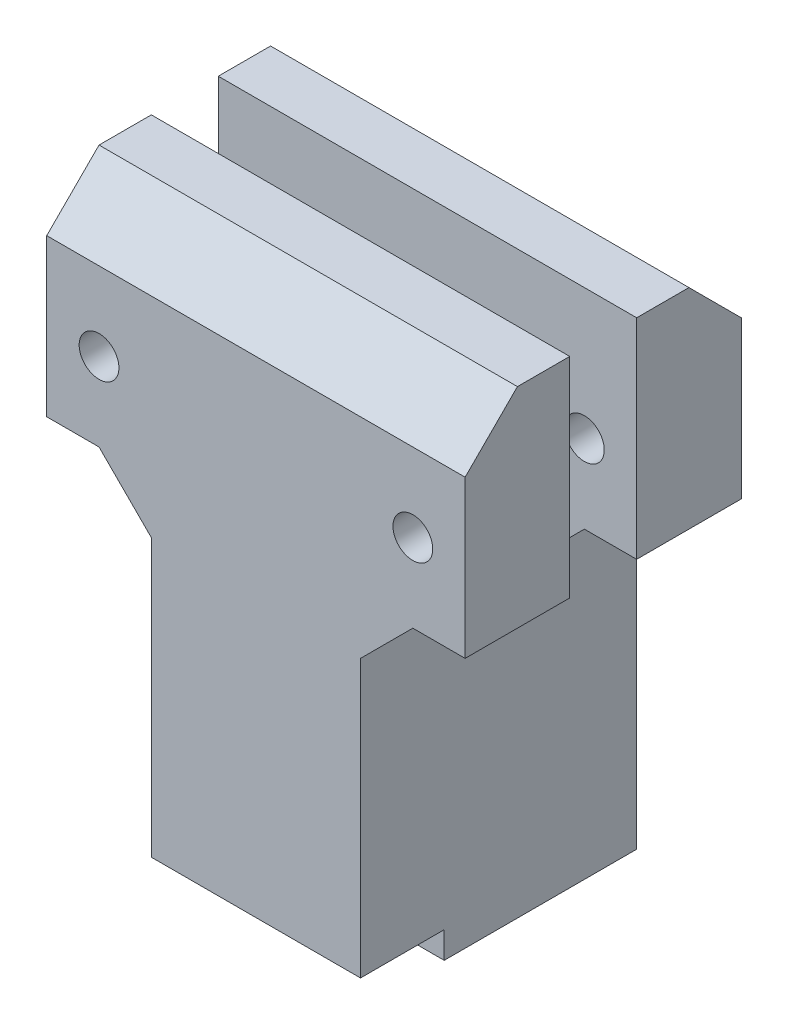
ISO-10303-21;
HEADER;
FILE_DESCRIPTION(('STEP AP214'),'2;1');
FILE_NAME('part.step','',(''),(''),'','','');
FILE_SCHEMA(('AUTOMOTIVE_DESIGN { 1 0 10303 214 1 1 1 1 }'));
ENDSEC;
DATA;
#1=APPLICATION_CONTEXT('core data for automotive mechanical design processes');
#2=APPLICATION_PROTOCOL_DEFINITION('international standard','automotive_design',2000,#1);
#3=PRODUCT_CONTEXT('',#1,'mechanical');
#4=PRODUCT('Part','Part','',(#3));
#5=PRODUCT_RELATED_PRODUCT_CATEGORY('part','',(#4));
#6=PRODUCT_DEFINITION_FORMATION('','',#4);
#7=PRODUCT_DEFINITION_CONTEXT('part definition',#1,'design');
#8=PRODUCT_DEFINITION('design','',#6,#7);
#9=PRODUCT_DEFINITION_SHAPE('','',#8);
#10=(LENGTH_UNIT() NAMED_UNIT(*) SI_UNIT(.MILLI.,.METRE.));
#11=(NAMED_UNIT(*) PLANE_ANGLE_UNIT() SI_UNIT($,.RADIAN.));
#12=(NAMED_UNIT(*) SI_UNIT($,.STERADIAN.) SOLID_ANGLE_UNIT());
#13=UNCERTAINTY_MEASURE_WITH_UNIT(LENGTH_MEASURE(1.E-05),#10,'distance_accuracy_value','');
#14=(GEOMETRIC_REPRESENTATION_CONTEXT(3) GLOBAL_UNCERTAINTY_ASSIGNED_CONTEXT((#13)) GLOBAL_UNIT_ASSIGNED_CONTEXT((#10,
#11,#12)) REPRESENTATION_CONTEXT('',''));
#15=CARTESIAN_POINT('',(0.,0.,0.));
#16=DIRECTION('',(0.,0.,1.));
#17=DIRECTION('',(1.,0.,0.));
#18=AXIS2_PLACEMENT_3D('',#15,#16,#17);
#19=CARTESIAN_POINT('',(-12.7,25.4,0.));
#20=DIRECTION('',(-1.,0.,0.));
#21=DIRECTION('',(0.,0.,1.));
#22=AXIS2_PLACEMENT_3D('',#19,#20,#21);
#23=PLANE('',#22);
#24=DIRECTION('',(0.,0.,-1.));
#25=VECTOR('',#24,1.);
#26=CARTESIAN_POINT('',(-12.7,0.,0.));
#27=LINE('',#26,#25);
#28=CARTESIAN_POINT('',(-12.7,0.,4.064));
#29=VERTEX_POINT('',#28);
#30=CARTESIAN_POINT('',(-12.7,0.,-4.064));
#31=VERTEX_POINT('',#30);
#32=EDGE_CURVE('E217',#29,#31,#27,.T.);
#33=ORIENTED_EDGE('',*,*,#32,.T.);
#34=DIRECTION('',(0.,-1.,0.));
#35=VECTOR('',#34,1.);
#36=CARTESIAN_POINT('',(-12.7,25.4,-4.064));
#37=LINE('',#36,#35);
#38=CARTESIAN_POINT('',(-12.7,-6.34999999999998,-4.064));
#39=VERTEX_POINT('',#38);
#40=EDGE_CURVE('E58',#31,#39,#37,.T.);
#41=ORIENTED_EDGE('',*,*,#40,.T.);
#42=DIRECTION('',(0.,0.,-1.));
#43=VECTOR('',#42,1.);
#44=CARTESIAN_POINT('',(-12.7,-6.34999999999998,0.));
#45=LINE('',#44,#43);
#46=CARTESIAN_POINT('',(-12.7,-6.34999999999998,-16.764));
#47=VERTEX_POINT('',#46);
#48=EDGE_CURVE('E386',#39,#47,#45,.T.);
#49=ORIENTED_EDGE('',*,*,#48,.T.);
#50=DIRECTION('',(0.,-1.,0.));
#51=VECTOR('',#50,1.);
#52=CARTESIAN_POINT('',(-12.7,25.4,-16.764));
#53=LINE('',#52,#51);
#54=CARTESIAN_POINT('',(-12.7,-43.184694682,-16.764));
#55=VERTEX_POINT('',#54);
#56=EDGE_CURVE('E345',#47,#55,#53,.T.);
#57=ORIENTED_EDGE('',*,*,#56,.T.);
#58=DIRECTION('',(0.,0.,-1.));
#59=VECTOR('',#58,1.);
#60=CARTESIAN_POINT('',(-12.7,-43.184694682,0.));
#61=LINE('',#60,#59);
#62=CARTESIAN_POINT('',(-12.7,-43.184694682,6.604));
#63=VERTEX_POINT('',#62);
#64=EDGE_CURVE('E323',#63,#55,#61,.T.);
#65=ORIENTED_EDGE('',*,*,#64,.F.);
#66=DIRECTION('',(0.,-1.,0.));
#67=VECTOR('',#66,1.);
#68=CARTESIAN_POINT('',(-12.7,-43.184694682,6.604));
#69=LINE('',#68,#67);
#70=CARTESIAN_POINT('',(-12.7,-39.958894682,6.604));
#71=VERTEX_POINT('',#70);
#72=EDGE_CURVE('E306',#71,#63,#69,.T.);
#73=ORIENTED_EDGE('',*,*,#72,.F.);
#74=DIRECTION('',(0.,0.,1.));
#75=VECTOR('',#74,1.);
#76=CARTESIAN_POINT('',(-12.7,-39.958894682,6.604));
#77=LINE('',#76,#75);
#78=CARTESIAN_POINT('',(-12.7,-39.958894682,16.764));
#79=VERTEX_POINT('',#78);
#80=EDGE_CURVE('E317',#71,#79,#77,.T.);
#81=ORIENTED_EDGE('',*,*,#80,.T.);
#82=DIRECTION('',(0.,1.,0.));
#83=VECTOR('',#82,1.);
#84=CARTESIAN_POINT('',(-12.7,-43.184694682,16.764));
#85=LINE('',#84,#83);
#86=CARTESIAN_POINT('',(-12.7,-6.34999999999997,16.764));
#87=VERTEX_POINT('',#86);
#88=EDGE_CURVE('E333',#79,#87,#85,.T.);
#89=ORIENTED_EDGE('',*,*,#88,.T.);
#90=DIRECTION('',(0.,0.,-1.));
#91=VECTOR('',#90,1.);
#92=CARTESIAN_POINT('',(-12.7,-6.34999999999997,0.));
#93=LINE('',#92,#91);
#94=CARTESIAN_POINT('',(-12.7,-6.34999999999997,4.064));
#95=VERTEX_POINT('',#94);
#96=EDGE_CURVE('E383',#87,#95,#93,.T.);
#97=ORIENTED_EDGE('',*,*,#96,.T.);
#98=DIRECTION('',(0.,1.,0.));
#99=VECTOR('',#98,1.);
#100=CARTESIAN_POINT('',(-12.7,25.4,4.064));
#101=LINE('',#100,#99);
#102=EDGE_CURVE('E381',#95,#29,#101,.T.);
#103=ORIENTED_EDGE('',*,*,#102,.T.);
#104=EDGE_LOOP('',(#33,#41,#49,#57,#65,#73,#81,#89,#97,#103));
#105=FACE_BOUND('',#104,.T.);
#106=ADVANCED_FACE('F42',(#105),#23,.T.);
#107=CARTESIAN_POINT('',(0.,25.4,-4.064));
#108=DIRECTION('',(0.,0.,-1.));
#109=DIRECTION('',(-1.,0.,0.));
#110=AXIS2_PLACEMENT_3D('',#107,#108,#109);
#111=PLANE('',#110);
#112=CARTESIAN_POINT('',(-19.05,9.52499999999998,-4.064));
#113=DIRECTION('',(0.,0.,-1.));
#114=DIRECTION('',(-1.,0.,0.));
#115=AXIS2_PLACEMENT_3D('',#112,#113,#114);
#116=CIRCLE('',#115,2.413);
#117=CARTESIAN_POINT('',(-21.463,9.52499999999998,-4.064));
#118=VERTEX_POINT('',#117);
#119=EDGE_CURVE('E229',#118,#118,#116,.T.);
#120=ORIENTED_EDGE('',*,*,#119,.T.);
#121=EDGE_LOOP('',(#120));
#122=FACE_BOUND('',#121,.T.);
#123=CARTESIAN_POINT('',(19.05,9.52499999999998,-4.064));
#124=DIRECTION('',(0.,0.,-1.));
#125=DIRECTION('',(-1.,0.,0.));
#126=AXIS2_PLACEMENT_3D('',#123,#124,#125);
#127=CIRCLE('',#126,2.413);
#128=CARTESIAN_POINT('',(16.637,9.52499999999998,-4.064));
#129=VERTEX_POINT('',#128);
#130=EDGE_CURVE('E360',#129,#129,#127,.T.);
#131=ORIENTED_EDGE('',*,*,#130,.T.);
#132=EDGE_LOOP('',(#131));
#133=FACE_BOUND('',#132,.T.);
#134=DIRECTION('',(1.,0.,0.));
#135=VECTOR('',#134,1.);
#136=CARTESIAN_POINT('',(0.,0.,-4.064));
#137=LINE('',#136,#135);
#138=CARTESIAN_POINT('',(12.7,0.,-4.064));
#139=VERTEX_POINT('',#138);
#140=EDGE_CURVE('E340',#31,#139,#137,.T.);
#141=ORIENTED_EDGE('',*,*,#140,.T.);
#142=DIRECTION('',(0.,1.,0.));
#143=VECTOR('',#142,1.);
#144=CARTESIAN_POINT('',(12.7,25.4,-4.064));
#145=LINE('',#144,#143);
#146=CARTESIAN_POINT('',(12.7,-6.35000000000006,-4.064));
#147=VERTEX_POINT('',#146);
#148=EDGE_CURVE('E369',#147,#139,#145,.T.);
#149=ORIENTED_EDGE('',*,*,#148,.F.);
#150=DIRECTION('',(0.707106781186545,0.707106781186551,0.));
#151=VECTOR('',#150,1.);
#152=CARTESIAN_POINT('',(22.2250000000001,3.1750000000001,-4.064));
#153=LINE('',#152,#151);
#154=CARTESIAN_POINT('',(19.05,0.,-4.064));
#155=VERTEX_POINT('',#154);
#156=EDGE_CURVE('E392',#147,#155,#153,.T.);
#157=ORIENTED_EDGE('',*,*,#156,.T.);
#158=DIRECTION('',(-1.,0.,0.));
#159=VECTOR('',#158,1.);
#160=CARTESIAN_POINT('',(25.4,0.,-4.064));
#161=LINE('',#160,#159);
#162=CARTESIAN_POINT('',(25.4,0.,-4.064));
#163=VERTEX_POINT('',#162);
#164=EDGE_CURVE('E265',#163,#155,#161,.T.);
#165=ORIENTED_EDGE('',*,*,#164,.F.);
#166=DIRECTION('',(0.,1.,0.));
#167=VECTOR('',#166,1.);
#168=CARTESIAN_POINT('',(25.4,0.,-4.064));
#169=LINE('',#168,#167);
#170=CARTESIAN_POINT('',(25.4,25.4,-4.064));
#171=VERTEX_POINT('',#170);
#172=EDGE_CURVE('E256',#163,#171,#169,.T.);
#173=ORIENTED_EDGE('',*,*,#172,.T.);
#174=DIRECTION('',(1.,0.,0.));
#175=VECTOR('',#174,1.);
#176=CARTESIAN_POINT('',(0.,25.4,-4.064));
#177=LINE('',#176,#175);
#178=CARTESIAN_POINT('',(-25.4,25.4,-4.064));
#179=VERTEX_POINT('',#178);
#180=EDGE_CURVE('E343',#179,#171,#177,.T.);
#181=ORIENTED_EDGE('',*,*,#180,.F.);
#182=DIRECTION('',(0.,1.,0.));
#183=VECTOR('',#182,1.);
#184=CARTESIAN_POINT('',(-25.4,0.,-4.064));
#185=LINE('',#184,#183);
#186=CARTESIAN_POINT('',(-25.4,0.,-4.064));
#187=VERTEX_POINT('',#186);
#188=EDGE_CURVE('E290',#187,#179,#185,.T.);
#189=ORIENTED_EDGE('',*,*,#188,.F.);
#190=DIRECTION('',(1.,0.,0.));
#191=VECTOR('',#190,1.);
#192=CARTESIAN_POINT('',(-25.4,0.,-4.064));
#193=LINE('',#192,#191);
#194=CARTESIAN_POINT('',(-19.0500000000001,0.,-4.064));
#195=VERTEX_POINT('',#194);
#196=EDGE_CURVE('E299',#187,#195,#193,.T.);
#197=ORIENTED_EDGE('',*,*,#196,.T.);
#198=DIRECTION('',(0.707106781186551,-0.707106781186544,0.));
#199=VECTOR('',#198,1.);
#200=CARTESIAN_POINT('',(-22.2249999999999,3.17499999999983,-4.064));
#201=LINE('',#200,#199);
#202=EDGE_CURVE('E400',#195,#39,#201,.T.);
#203=ORIENTED_EDGE('',*,*,#202,.T.);
#204=ORIENTED_EDGE('',*,*,#40,.F.);
#205=EDGE_LOOP('',(#141,#149,#157,#165,#173,#181,#189,#197,#203,#204));
#206=FACE_BOUND('',#205,.T.);
#207=ADVANCED_FACE('F467',(#122,#133,#206),#111,.F.);
#208=CARTESIAN_POINT('',(12.7,25.4,0.));
#209=DIRECTION('',(-1.,0.,0.));
#210=DIRECTION('',(0.,0.,1.));
#211=AXIS2_PLACEMENT_3D('',#208,#209,#210);
#212=PLANE('',#211);
#213=DIRECTION('',(0.,-1.,0.));
#214=VECTOR('',#213,1.);
#215=CARTESIAN_POINT('',(12.7,25.4,-16.764));
#216=LINE('',#215,#214);
#217=CARTESIAN_POINT('',(12.7,-6.35000000000006,-16.764));
#218=VERTEX_POINT('',#217);
#219=CARTESIAN_POINT('',(12.7,-43.184694682,-16.764));
#220=VERTEX_POINT('',#219);
#221=EDGE_CURVE('E348',#218,#220,#216,.T.);
#222=ORIENTED_EDGE('',*,*,#221,.F.);
#223=DIRECTION('',(0.,0.,1.));
#224=VECTOR('',#223,1.);
#225=CARTESIAN_POINT('',(12.7,-6.35000000000006,0.));
#226=LINE('',#225,#224);
#227=EDGE_CURVE('E371',#218,#147,#226,.T.);
#228=ORIENTED_EDGE('',*,*,#227,.T.);
#229=ORIENTED_EDGE('',*,*,#148,.T.);
#230=DIRECTION('',(0.,0.,-1.));
#231=VECTOR('',#230,1.);
#232=CARTESIAN_POINT('',(12.7,0.,0.));
#233=LINE('',#232,#231);
#234=CARTESIAN_POINT('',(12.7,0.,4.064));
#235=VERTEX_POINT('',#234);
#236=EDGE_CURVE('E327',#235,#139,#233,.T.);
#237=ORIENTED_EDGE('',*,*,#236,.F.);
#238=DIRECTION('',(0.,-1.,0.));
#239=VECTOR('',#238,1.);
#240=CARTESIAN_POINT('',(12.7,25.4,4.064));
#241=LINE('',#240,#239);
#242=CARTESIAN_POINT('',(12.7,-6.35000000000005,4.064));
#243=VERTEX_POINT('',#242);
#244=EDGE_CURVE('E66',#235,#243,#241,.T.);
#245=ORIENTED_EDGE('',*,*,#244,.T.);
#246=DIRECTION('',(0.,0.,1.));
#247=VECTOR('',#246,1.);
#248=CARTESIAN_POINT('',(12.7,-6.35000000000005,0.));
#249=LINE('',#248,#247);
#250=CARTESIAN_POINT('',(12.7,-6.35000000000005,16.764));
#251=VERTEX_POINT('',#250);
#252=EDGE_CURVE('E366',#243,#251,#249,.T.);
#253=ORIENTED_EDGE('',*,*,#252,.T.);
#254=DIRECTION('',(0.,1.,0.));
#255=VECTOR('',#254,1.);
#256=CARTESIAN_POINT('',(12.7,-43.184694682,16.764));
#257=LINE('',#256,#255);
#258=CARTESIAN_POINT('',(12.7,-39.958894682,16.764));
#259=VERTEX_POINT('',#258);
#260=EDGE_CURVE('E337',#259,#251,#257,.T.);
#261=ORIENTED_EDGE('',*,*,#260,.F.);
#262=DIRECTION('',(0.,0.,1.));
#263=VECTOR('',#262,1.);
#264=CARTESIAN_POINT('',(12.7,-39.958894682,6.604));
#265=LINE('',#264,#263);
#266=CARTESIAN_POINT('',(12.7,-39.958894682,6.604));
#267=VERTEX_POINT('',#266);
#268=EDGE_CURVE('E315',#267,#259,#265,.T.);
#269=ORIENTED_EDGE('',*,*,#268,.F.);
#270=DIRECTION('',(0.,1.,0.));
#271=VECTOR('',#270,1.);
#272=CARTESIAN_POINT('',(12.7,-43.184694682,6.604));
#273=LINE('',#272,#271);
#274=CARTESIAN_POINT('',(12.7,-43.184694682,6.604));
#275=VERTEX_POINT('',#274);
#276=EDGE_CURVE('E310',#275,#267,#273,.T.);
#277=ORIENTED_EDGE('',*,*,#276,.F.);
#278=DIRECTION('',(0.,0.,-1.));
#279=VECTOR('',#278,1.);
#280=CARTESIAN_POINT('',(12.7,-43.184694682,0.));
#281=LINE('',#280,#279);
#282=EDGE_CURVE('E326',#275,#220,#281,.T.);
#283=ORIENTED_EDGE('',*,*,#282,.T.);
#284=EDGE_LOOP('',(#222,#228,#229,#237,#245,#253,#261,#269,#277,#283));
#285=FACE_BOUND('',#284,.T.);
#286=ADVANCED_FACE('F431',(#285),#212,.F.);
#287=CARTESIAN_POINT('',(0.,25.4,-16.764));
#288=DIRECTION('',(0.,0.,1.));
#289=DIRECTION('',(1.,0.,0.));
#290=AXIS2_PLACEMENT_3D('',#287,#288,#289);
#291=PLANE('',#290);
#292=CARTESIAN_POINT('',(-19.05,9.52499999999998,-16.764));
#293=DIRECTION('',(0.,0.,1.));
#294=DIRECTION('',(1.,0.,0.));
#295=AXIS2_PLACEMENT_3D('',#292,#293,#294);
#296=CIRCLE('',#295,2.413);
#297=CARTESIAN_POINT('',(-16.637,9.52499999999998,-16.764));
#298=VERTEX_POINT('',#297);
#299=EDGE_CURVE('E361',#298,#298,#296,.T.);
#300=ORIENTED_EDGE('',*,*,#299,.T.);
#301=EDGE_LOOP('',(#300));
#302=FACE_BOUND('',#301,.T.);
#303=CARTESIAN_POINT('',(19.05,9.52499999999998,-16.764));
#304=DIRECTION('',(0.,0.,1.));
#305=DIRECTION('',(1.,0.,0.));
#306=AXIS2_PLACEMENT_3D('',#303,#304,#305);
#307=CIRCLE('',#306,2.413);
#308=CARTESIAN_POINT('',(21.463,9.52499999999998,-16.764));
#309=VERTEX_POINT('',#308);
#310=EDGE_CURVE('E919',#309,#309,#307,.T.);
#311=ORIENTED_EDGE('',*,*,#310,.T.);
#312=EDGE_LOOP('',(#311));
#313=FACE_BOUND('',#312,.T.);
#314=ORIENTED_EDGE('',*,*,#56,.F.);
#315=DIRECTION('',(-0.707106781186551,0.707106781186544,0.));
#316=VECTOR('',#315,1.);
#317=CARTESIAN_POINT('',(-22.2249999999999,3.17499999999983,-16.764));
#318=LINE('',#317,#316);
#319=CARTESIAN_POINT('',(-19.0500000000001,0.,-16.764));
#320=VERTEX_POINT('',#319);
#321=EDGE_CURVE('E402',#47,#320,#318,.T.);
#322=ORIENTED_EDGE('',*,*,#321,.T.);
#323=DIRECTION('',(1.,0.,0.));
#324=VECTOR('',#323,1.);
#325=CARTESIAN_POINT('',(-25.4,0.,-16.764));
#326=LINE('',#325,#324);
#327=CARTESIAN_POINT('',(-25.4,0.,-16.764));
#328=VERTEX_POINT('',#327);
#329=EDGE_CURVE('E302',#328,#320,#326,.T.);
#330=ORIENTED_EDGE('',*,*,#329,.F.);
#331=DIRECTION('',(0.,-1.,0.));
#332=VECTOR('',#331,1.);
#333=CARTESIAN_POINT('',(-25.4,0.,-16.764));
#334=LINE('',#333,#332);
#335=CARTESIAN_POINT('',(-25.4,19.05,-16.764));
#336=VERTEX_POINT('',#335);
#337=EDGE_CURVE('E285',#336,#328,#334,.T.);
#338=ORIENTED_EDGE('',*,*,#337,.F.);
#339=DIRECTION('',(1.,0.,0.));
#340=VECTOR('',#339,1.);
#341=CARTESIAN_POINT('',(12.7,19.05,-16.764));
#342=LINE('',#341,#340);
#343=CARTESIAN_POINT('',(25.4,19.05,-16.764));
#344=VERTEX_POINT('',#343);
#345=EDGE_CURVE('E352',#336,#344,#342,.T.);
#346=ORIENTED_EDGE('',*,*,#345,.T.);
#347=DIRECTION('',(0.,-1.,0.));
#348=VECTOR('',#347,1.);
#349=CARTESIAN_POINT('',(25.4,0.,-16.764));
#350=LINE('',#349,#348);
#351=CARTESIAN_POINT('',(25.4,0.,-16.764));
#352=VERTEX_POINT('',#351);
#353=EDGE_CURVE('E247',#344,#352,#350,.T.);
#354=ORIENTED_EDGE('',*,*,#353,.T.);
#355=DIRECTION('',(-1.,0.,0.));
#356=VECTOR('',#355,1.);
#357=CARTESIAN_POINT('',(25.4,0.,-16.764));
#358=LINE('',#357,#356);
#359=CARTESIAN_POINT('',(19.05,0.,-16.764));
#360=VERTEX_POINT('',#359);
#361=EDGE_CURVE('E262',#352,#360,#358,.T.);
#362=ORIENTED_EDGE('',*,*,#361,.T.);
#363=DIRECTION('',(-0.707106781186545,-0.707106781186551,0.));
#364=VECTOR('',#363,1.);
#365=CARTESIAN_POINT('',(22.2250000000001,3.1750000000001,-16.764));
#366=LINE('',#365,#364);
#367=EDGE_CURVE('E394',#360,#218,#366,.T.);
#368=ORIENTED_EDGE('',*,*,#367,.T.);
#369=ORIENTED_EDGE('',*,*,#221,.T.);
#370=DIRECTION('',(-1.,0.,0.));
#371=VECTOR('',#370,1.);
#372=CARTESIAN_POINT('',(0.,-43.184694682,-16.764));
#373=LINE('',#372,#371);
#374=EDGE_CURVE('E330',#220,#55,#373,.T.);
#375=ORIENTED_EDGE('',*,*,#374,.T.);
#376=EDGE_LOOP('',(#314,#322,#330,#338,#346,#354,#362,#368,#369,#375));
#377=FACE_BOUND('',#376,.T.);
#378=ADVANCED_FACE('F446',(#302,#313,#377),#291,.F.);
#379=CARTESIAN_POINT('',(0.,25.4,0.));
#380=DIRECTION('',(0.,1.,0.));
#381=DIRECTION('',(0.,0.,1.));
#382=AXIS2_PLACEMENT_3D('',#379,#380,#381);
#383=PLANE('',#382);
#384=ORIENTED_EDGE('',*,*,#180,.T.);
#385=DIRECTION('',(0.,0.,-1.));
#386=VECTOR('',#385,1.);
#387=CARTESIAN_POINT('',(25.4,25.4,0.));
#388=LINE('',#387,#386);
#389=CARTESIAN_POINT('',(25.4,25.4,-10.414));
#390=VERTEX_POINT('',#389);
#391=EDGE_CURVE('E253',#171,#390,#388,.T.);
#392=ORIENTED_EDGE('',*,*,#391,.T.);
#393=DIRECTION('',(-1.,0.,0.));
#394=VECTOR('',#393,1.);
#395=CARTESIAN_POINT('',(-12.7,25.4,-10.414));
#396=LINE('',#395,#394);
#397=CARTESIAN_POINT('',(-25.4,25.4,-10.414));
#398=VERTEX_POINT('',#397);
#399=EDGE_CURVE('E350',#390,#398,#396,.T.);
#400=ORIENTED_EDGE('',*,*,#399,.T.);
#401=DIRECTION('',(0.,0.,-1.));
#402=VECTOR('',#401,1.);
#403=CARTESIAN_POINT('',(-25.4,25.4,0.));
#404=LINE('',#403,#402);
#405=EDGE_CURVE('E293',#179,#398,#404,.T.);
#406=ORIENTED_EDGE('',*,*,#405,.F.);
#407=EDGE_LOOP('',(#384,#392,#400,#406));
#408=FACE_BOUND('',#407,.T.);
#409=ADVANCED_FACE('F466',(#408),#383,.T.);
#410=CARTESIAN_POINT('',(0.,0.,0.));
#411=DIRECTION('',(0.,1.,0.));
#412=DIRECTION('',(0.,0.,1.));
#413=AXIS2_PLACEMENT_3D('',#410,#411,#412);
#414=PLANE('',#413);
#415=DIRECTION('',(1.,0.,0.));
#416=VECTOR('',#415,1.);
#417=CARTESIAN_POINT('',(0.,0.,4.064));
#418=LINE('',#417,#416);
#419=EDGE_CURVE('E218',#29,#235,#418,.T.);
#420=ORIENTED_EDGE('',*,*,#419,.T.);
#421=ORIENTED_EDGE('',*,*,#236,.T.);
#422=ORIENTED_EDGE('',*,*,#140,.F.);
#423=ORIENTED_EDGE('',*,*,#32,.F.);
#424=EDGE_LOOP('',(#420,#421,#422,#423));
#425=FACE_BOUND('',#424,.T.);
#426=ADVANCED_FACE('F437',(#425),#414,.T.);
#427=CARTESIAN_POINT('',(0.,-43.184694682,16.764));
#428=DIRECTION('',(0.,0.,-1.));
#429=DIRECTION('',(-1.,0.,0.));
#430=AXIS2_PLACEMENT_3D('',#427,#428,#429);
#431=PLANE('',#430);
#432=CARTESIAN_POINT('',(-19.05,9.52499999999998,16.764));
#433=DIRECTION('',(0.,0.,1.));
#434=DIRECTION('',(1.,0.,0.));
#435=AXIS2_PLACEMENT_3D('',#432,#433,#434);
#436=CIRCLE('',#435,2.413);
#437=CARTESIAN_POINT('',(-16.637,9.52499999999998,16.764));
#438=VERTEX_POINT('',#437);
#439=EDGE_CURVE('E922',#438,#438,#436,.T.);
#440=ORIENTED_EDGE('',*,*,#439,.F.);
#441=EDGE_LOOP('',(#440));
#442=FACE_BOUND('',#441,.T.);
#443=CARTESIAN_POINT('',(19.05,9.52499999999998,16.764));
#444=DIRECTION('',(0.,0.,1.));
#445=DIRECTION('',(1.,0.,0.));
#446=AXIS2_PLACEMENT_3D('',#443,#444,#445);
#447=CIRCLE('',#446,2.413);
#448=CARTESIAN_POINT('',(21.463,9.52499999999998,16.764));
#449=VERTEX_POINT('',#448);
#450=EDGE_CURVE('E917',#449,#449,#447,.T.);
#451=ORIENTED_EDGE('',*,*,#450,.F.);
#452=EDGE_LOOP('',(#451));
#453=FACE_BOUND('',#452,.T.);
#454=ORIENTED_EDGE('',*,*,#260,.T.);
#455=DIRECTION('',(0.707106781186545,0.707106781186551,0.));
#456=VECTOR('',#455,1.);
#457=CARTESIAN_POINT('',(-12.0673473409999,-31.1173473410002,16.764));
#458=LINE('',#457,#456);
#459=CARTESIAN_POINT('',(19.05,0.,16.764));
#460=VERTEX_POINT('',#459);
#461=EDGE_CURVE('E396',#251,#460,#458,.T.);
#462=ORIENTED_EDGE('',*,*,#461,.T.);
#463=DIRECTION('',(-1.,0.,0.));
#464=VECTOR('',#463,1.);
#465=CARTESIAN_POINT('',(25.4,0.,16.764));
#466=LINE('',#465,#464);
#467=CARTESIAN_POINT('',(25.4,0.,16.764));
#468=VERTEX_POINT('',#467);
#469=EDGE_CURVE('E244',#468,#460,#466,.T.);
#470=ORIENTED_EDGE('',*,*,#469,.F.);
#471=DIRECTION('',(0.,1.,0.));
#472=VECTOR('',#471,1.);
#473=CARTESIAN_POINT('',(25.4,0.,16.764));
#474=LINE('',#473,#472);
#475=CARTESIAN_POINT('',(25.4,19.05,16.764));
#476=VERTEX_POINT('',#475);
#477=EDGE_CURVE('E235',#468,#476,#474,.T.);
#478=ORIENTED_EDGE('',*,*,#477,.T.);
#479=DIRECTION('',(-1.,0.,0.));
#480=VECTOR('',#479,1.);
#481=CARTESIAN_POINT('',(-12.7,19.05,16.764));
#482=LINE('',#481,#480);
#483=CARTESIAN_POINT('',(-25.4,19.05,16.764));
#484=VERTEX_POINT('',#483);
#485=EDGE_CURVE('E354',#476,#484,#482,.T.);
#486=ORIENTED_EDGE('',*,*,#485,.T.);
#487=DIRECTION('',(0.,1.,0.));
#488=VECTOR('',#487,1.);
#489=CARTESIAN_POINT('',(-25.4,0.,16.764));
#490=LINE('',#489,#488);
#491=CARTESIAN_POINT('',(-25.4,0.,16.764));
#492=VERTEX_POINT('',#491);
#493=EDGE_CURVE('E271',#492,#484,#490,.T.);
#494=ORIENTED_EDGE('',*,*,#493,.F.);
#495=DIRECTION('',(1.,0.,0.));
#496=VECTOR('',#495,1.);
#497=CARTESIAN_POINT('',(-25.4,0.,16.764));
#498=LINE('',#497,#496);
#499=CARTESIAN_POINT('',(-19.05,0.,16.764));
#500=VERTEX_POINT('',#499);
#501=EDGE_CURVE('E279',#492,#500,#498,.T.);
#502=ORIENTED_EDGE('',*,*,#501,.T.);
#503=DIRECTION('',(0.707106781186551,-0.707106781186544,0.));
#504=VECTOR('',#503,1.);
#505=CARTESIAN_POINT('',(12.0673473410001,-31.1173473409998,16.764));
#506=LINE('',#505,#504);
#507=EDGE_CURVE('E51',#500,#87,#506,.T.);
#508=ORIENTED_EDGE('',*,*,#507,.T.);
#509=ORIENTED_EDGE('',*,*,#88,.F.);
#510=DIRECTION('',(-1.,0.,0.));
#511=VECTOR('',#510,1.);
#512=CARTESIAN_POINT('',(-12.7,-39.958894682,16.764));
#513=LINE('',#512,#511);
#514=EDGE_CURVE('E305',#259,#79,#513,.T.);
#515=ORIENTED_EDGE('',*,*,#514,.F.);
#516=EDGE_LOOP('',(#454,#462,#470,#478,#486,#494,#502,#508,#509,#515));
#517=FACE_BOUND('',#516,.T.);
#518=ADVANCED_FACE('F405',(#442,#453,#517),#431,.F.);
#519=CARTESIAN_POINT('',(0.,-43.184694682,0.));
#520=DIRECTION('',(0.,1.,0.));
#521=DIRECTION('',(0.,0.,1.));
#522=AXIS2_PLACEMENT_3D('',#519,#520,#521);
#523=PLANE('',#522);
#524=ORIENTED_EDGE('',*,*,#282,.F.);
#525=DIRECTION('',(1.,0.,0.));
#526=VECTOR('',#525,1.);
#527=CARTESIAN_POINT('',(-12.7,-43.184694682,6.604));
#528=LINE('',#527,#526);
#529=EDGE_CURVE('E308',#63,#275,#528,.T.);
#530=ORIENTED_EDGE('',*,*,#529,.F.);
#531=ORIENTED_EDGE('',*,*,#64,.T.);
#532=ORIENTED_EDGE('',*,*,#374,.F.);
#533=EDGE_LOOP('',(#524,#530,#531,#532));
#534=FACE_BOUND('',#533,.T.);
#535=ADVANCED_FACE('F479',(#534),#523,.F.);
#536=CARTESIAN_POINT('',(0.,25.4,4.064));
#537=DIRECTION('',(0.,0.,-1.));
#538=DIRECTION('',(-1.,0.,0.));
#539=AXIS2_PLACEMENT_3D('',#536,#537,#538);
#540=PLANE('',#539);
#541=CARTESIAN_POINT('',(-19.05,9.52499999999998,4.064));
#542=DIRECTION('',(0.,0.,-1.));
#543=DIRECTION('',(-1.,0.,0.));
#544=AXIS2_PLACEMENT_3D('',#541,#542,#543);
#545=CIRCLE('',#544,2.413);
#546=CARTESIAN_POINT('',(-21.463,9.52499999999998,4.064));
#547=VERTEX_POINT('',#546);
#548=EDGE_CURVE('E362',#547,#547,#545,.T.);
#549=ORIENTED_EDGE('',*,*,#548,.F.);
#550=EDGE_LOOP('',(#549));
#551=FACE_BOUND('',#550,.T.);
#552=CARTESIAN_POINT('',(19.05,9.52499999999998,4.064));
#553=DIRECTION('',(0.,0.,-1.));
#554=DIRECTION('',(-1.,0.,0.));
#555=AXIS2_PLACEMENT_3D('',#552,#553,#554);
#556=CIRCLE('',#555,2.413);
#557=CARTESIAN_POINT('',(16.637,9.52499999999998,4.064));
#558=VERTEX_POINT('',#557);
#559=EDGE_CURVE('E357',#558,#558,#556,.T.);
#560=ORIENTED_EDGE('',*,*,#559,.F.);
#561=EDGE_LOOP('',(#560));
#562=FACE_BOUND('',#561,.T.);
#563=ORIENTED_EDGE('',*,*,#419,.F.);
#564=ORIENTED_EDGE('',*,*,#102,.F.);
#565=DIRECTION('',(-0.707106781186551,0.707106781186544,0.));
#566=VECTOR('',#565,1.);
#567=CARTESIAN_POINT('',(-19.05,0.,4.064));
#568=LINE('',#567,#566);
#569=CARTESIAN_POINT('',(-19.05,0.,4.064));
#570=VERTEX_POINT('',#569);
#571=EDGE_CURVE('E11',#95,#570,#568,.T.);
#572=ORIENTED_EDGE('',*,*,#571,.T.);
#573=DIRECTION('',(1.,0.,0.));
#574=VECTOR('',#573,1.);
#575=CARTESIAN_POINT('',(-25.4,0.,4.064));
#576=LINE('',#575,#574);
#577=CARTESIAN_POINT('',(-25.4,0.,4.064));
#578=VERTEX_POINT('',#577);
#579=EDGE_CURVE('E282',#578,#570,#576,.T.);
#580=ORIENTED_EDGE('',*,*,#579,.F.);
#581=DIRECTION('',(0.,-1.,0.));
#582=VECTOR('',#581,1.);
#583=CARTESIAN_POINT('',(-25.4,0.,4.064));
#584=LINE('',#583,#582);
#585=CARTESIAN_POINT('',(-25.4,25.4,4.064));
#586=VERTEX_POINT('',#585);
#587=EDGE_CURVE('E212',#586,#578,#584,.T.);
#588=ORIENTED_EDGE('',*,*,#587,.F.);
#589=DIRECTION('',(1.,0.,0.));
#590=VECTOR('',#589,1.);
#591=CARTESIAN_POINT('',(0.,25.4,4.064));
#592=LINE('',#591,#590);
#593=CARTESIAN_POINT('',(25.4,25.4,4.064));
#594=VERTEX_POINT('',#593);
#595=EDGE_CURVE('E204',#586,#594,#592,.T.);
#596=ORIENTED_EDGE('',*,*,#595,.T.);
#597=DIRECTION('',(0.,-1.,0.));
#598=VECTOR('',#597,1.);
#599=CARTESIAN_POINT('',(25.4,0.,4.064));
#600=LINE('',#599,#598);
#601=CARTESIAN_POINT('',(25.4,0.,4.064));
#602=VERTEX_POINT('',#601);
#603=EDGE_CURVE('E208',#594,#602,#600,.T.);
#604=ORIENTED_EDGE('',*,*,#603,.T.);
#605=DIRECTION('',(-1.,0.,0.));
#606=VECTOR('',#605,1.);
#607=CARTESIAN_POINT('',(25.4,0.,4.064));
#608=LINE('',#607,#606);
#609=CARTESIAN_POINT('',(19.05,0.,4.064));
#610=VERTEX_POINT('',#609);
#611=EDGE_CURVE('E242',#602,#610,#608,.T.);
#612=ORIENTED_EDGE('',*,*,#611,.T.);
#613=DIRECTION('',(-0.707106781186545,-0.707106781186551,0.));
#614=VECTOR('',#613,1.);
#615=CARTESIAN_POINT('',(12.7,-6.35000000000005,4.064));
#616=LINE('',#615,#614);
#617=EDGE_CURVE('E398',#610,#243,#616,.T.);
#618=ORIENTED_EDGE('',*,*,#617,.T.);
#619=ORIENTED_EDGE('',*,*,#244,.F.);
#620=EDGE_LOOP('',(#563,#564,#572,#580,#588,#596,#604,#612,#618,#619));
#621=FACE_BOUND('',#620,.T.);
#622=ADVANCED_FACE('F206',(#551,#562,#621),#540,.T.);
#623=CARTESIAN_POINT('',(0.,25.4,0.));
#624=DIRECTION('',(0.,1.,0.));
#625=DIRECTION('',(0.,0.,1.));
#626=AXIS2_PLACEMENT_3D('',#623,#624,#625);
#627=PLANE('',#626);
#628=ORIENTED_EDGE('',*,*,#595,.F.);
#629=DIRECTION('',(0.,0.,-1.));
#630=VECTOR('',#629,1.);
#631=CARTESIAN_POINT('',(-25.4,25.4,0.));
#632=LINE('',#631,#630);
#633=CARTESIAN_POINT('',(-25.4,25.4,10.414));
#634=VERTEX_POINT('',#633);
#635=EDGE_CURVE('E277',#634,#586,#632,.T.);
#636=ORIENTED_EDGE('',*,*,#635,.F.);
#637=DIRECTION('',(1.,0.,0.));
#638=VECTOR('',#637,1.);
#639=CARTESIAN_POINT('',(12.7,25.4,10.414));
#640=LINE('',#639,#638);
#641=CARTESIAN_POINT('',(25.4,25.4,10.414));
#642=VERTEX_POINT('',#641);
#643=EDGE_CURVE('E232',#634,#642,#640,.T.);
#644=ORIENTED_EDGE('',*,*,#643,.T.);
#645=DIRECTION('',(0.,0.,-1.));
#646=VECTOR('',#645,1.);
#647=CARTESIAN_POINT('',(25.4,25.4,0.));
#648=LINE('',#647,#646);
#649=EDGE_CURVE('E224',#642,#594,#648,.T.);
#650=ORIENTED_EDGE('',*,*,#649,.T.);
#651=EDGE_LOOP('',(#628,#636,#644,#650));
#652=FACE_BOUND('',#651,.T.);
#653=ADVANCED_FACE('F231',(#652),#627,.T.);
#654=CARTESIAN_POINT('',(-12.7,-39.958894682,6.604));
#655=DIRECTION('',(0.,1.,0.));
#656=DIRECTION('',(0.,0.,1.));
#657=AXIS2_PLACEMENT_3D('',#654,#655,#656);
#658=PLANE('',#657);
#659=ORIENTED_EDGE('',*,*,#514,.T.);
#660=ORIENTED_EDGE('',*,*,#80,.F.);
#661=DIRECTION('',(-1.,0.,0.));
#662=VECTOR('',#661,1.);
#663=CARTESIAN_POINT('',(-12.7,-39.958894682,6.604));
#664=LINE('',#663,#662);
#665=EDGE_CURVE('E312',#267,#71,#664,.T.);
#666=ORIENTED_EDGE('',*,*,#665,.F.);
#667=ORIENTED_EDGE('',*,*,#268,.T.);
#668=EDGE_LOOP('',(#659,#660,#666,#667));
#669=FACE_BOUND('',#668,.T.);
#670=ADVANCED_FACE('F487',(#669),#658,.F.);
#671=CARTESIAN_POINT('',(0.,0.,6.604));
#672=DIRECTION('',(0.,0.,-1.));
#673=DIRECTION('',(-1.,0.,0.));
#674=AXIS2_PLACEMENT_3D('',#671,#672,#673);
#675=PLANE('',#674);
#676=ORIENTED_EDGE('',*,*,#72,.T.);
#677=ORIENTED_EDGE('',*,*,#529,.T.);
#678=ORIENTED_EDGE('',*,*,#276,.T.);
#679=ORIENTED_EDGE('',*,*,#665,.T.);
#680=EDGE_LOOP('',(#676,#677,#678,#679));
#681=FACE_BOUND('',#680,.T.);
#682=ADVANCED_FACE('F483',(#681),#675,.F.);
#683=CARTESIAN_POINT('',(0.,25.4,-10.414));
#684=DIRECTION('',(0.,0.707106781186547,-0.707106781186548));
#685=DIRECTION('',(1.,0.,0.));
#686=AXIS2_PLACEMENT_3D('',#683,#684,#685);
#687=PLANE('',#686);
#688=ORIENTED_EDGE('',*,*,#399,.F.);
#689=DIRECTION('',(0.,-0.707106781186548,-0.707106781186547));
#690=VECTOR('',#689,1.);
#691=CARTESIAN_POINT('',(25.4,17.907,-17.907));
#692=LINE('',#691,#690);
#693=EDGE_CURVE('E250',#390,#344,#692,.T.);
#694=ORIENTED_EDGE('',*,*,#693,.T.);
#695=ORIENTED_EDGE('',*,*,#345,.F.);
#696=DIRECTION('',(0.,-0.707106781186548,-0.707106781186547));
#697=VECTOR('',#696,1.);
#698=CARTESIAN_POINT('',(-25.4,17.907,-17.907));
#699=LINE('',#698,#697);
#700=EDGE_CURVE('E296',#398,#336,#699,.T.);
#701=ORIENTED_EDGE('',*,*,#700,.F.);
#702=EDGE_LOOP('',(#688,#694,#695,#701));
#703=FACE_BOUND('',#702,.T.);
#704=ADVANCED_FACE('F463',(#703),#687,.T.);
#705=CARTESIAN_POINT('',(0.,19.05,16.764));
#706=DIRECTION('',(0.,0.707106781186548,0.707106781186547));
#707=DIRECTION('',(1.,0.,0.));
#708=AXIS2_PLACEMENT_3D('',#705,#706,#707);
#709=PLANE('',#708);
#710=ORIENTED_EDGE('',*,*,#485,.F.);
#711=DIRECTION('',(0.,0.707106781186547,-0.707106781186548));
#712=VECTOR('',#711,1.);
#713=CARTESIAN_POINT('',(25.4,17.907,17.907));
#714=LINE('',#713,#712);
#715=EDGE_CURVE('E233',#476,#642,#714,.T.);
#716=ORIENTED_EDGE('',*,*,#715,.T.);
#717=ORIENTED_EDGE('',*,*,#643,.F.);
#718=DIRECTION('',(0.,0.707106781186547,-0.707106781186548));
#719=VECTOR('',#718,1.);
#720=CARTESIAN_POINT('',(-25.4,17.907,17.907));
#721=LINE('',#720,#719);
#722=EDGE_CURVE('E274',#484,#634,#721,.T.);
#723=ORIENTED_EDGE('',*,*,#722,.F.);
#724=EDGE_LOOP('',(#710,#716,#717,#723));
#725=FACE_BOUND('',#724,.T.);
#726=ADVANCED_FACE('F421',(#725),#709,.T.);
#727=CARTESIAN_POINT('',(-25.4,0.,0.));
#728=DIRECTION('',(0.,1.,0.));
#729=DIRECTION('',(0.,0.,1.));
#730=AXIS2_PLACEMENT_3D('',#727,#728,#729);
#731=PLANE('',#730);
#732=ORIENTED_EDGE('',*,*,#329,.T.);
#733=DIRECTION('',(0.,0.,1.));
#734=VECTOR('',#733,1.);
#735=CARTESIAN_POINT('',(-19.0500000000001,0.,0.));
#736=LINE('',#735,#734);
#737=EDGE_CURVE('E378',#320,#195,#736,.T.);
#738=ORIENTED_EDGE('',*,*,#737,.T.);
#739=ORIENTED_EDGE('',*,*,#196,.F.);
#740=DIRECTION('',(0.,0.,1.));
#741=VECTOR('',#740,1.);
#742=CARTESIAN_POINT('',(-25.4,0.,0.));
#743=LINE('',#742,#741);
#744=EDGE_CURVE('E288',#328,#187,#743,.T.);
#745=ORIENTED_EDGE('',*,*,#744,.F.);
#746=EDGE_LOOP('',(#732,#738,#739,#745));
#747=FACE_BOUND('',#746,.T.);
#748=ADVANCED_FACE('F449',(#747),#731,.F.);
#749=CARTESIAN_POINT('',(-25.4,0.,0.));
#750=DIRECTION('',(-1.,0.,0.));
#751=DIRECTION('',(0.,0.,1.));
#752=AXIS2_PLACEMENT_3D('',#749,#750,#751);
#753=PLANE('',#752);
#754=ORIENTED_EDGE('',*,*,#337,.T.);
#755=ORIENTED_EDGE('',*,*,#744,.T.);
#756=ORIENTED_EDGE('',*,*,#188,.T.);
#757=ORIENTED_EDGE('',*,*,#405,.T.);
#758=ORIENTED_EDGE('',*,*,#700,.T.);
#759=EDGE_LOOP('',(#754,#755,#756,#757,#758));
#760=FACE_BOUND('',#759,.T.);
#761=ADVANCED_FACE('F453',(#760),#753,.T.);
#762=CARTESIAN_POINT('',(-25.4,0.,0.));
#763=DIRECTION('',(0.,1.,0.));
#764=DIRECTION('',(0.,0.,1.));
#765=AXIS2_PLACEMENT_3D('',#762,#763,#764);
#766=PLANE('',#765);
#767=ORIENTED_EDGE('',*,*,#579,.T.);
#768=DIRECTION('',(0.,0.,1.));
#769=VECTOR('',#768,1.);
#770=CARTESIAN_POINT('',(-19.05,0.,0.));
#771=LINE('',#770,#769);
#772=EDGE_CURVE('E389',#570,#500,#771,.T.);
#773=ORIENTED_EDGE('',*,*,#772,.T.);
#774=ORIENTED_EDGE('',*,*,#501,.F.);
#775=DIRECTION('',(0.,0.,1.));
#776=VECTOR('',#775,1.);
#777=CARTESIAN_POINT('',(-25.4,0.,0.));
#778=LINE('',#777,#776);
#779=EDGE_CURVE('E269',#578,#492,#778,.T.);
#780=ORIENTED_EDGE('',*,*,#779,.F.);
#781=EDGE_LOOP('',(#767,#773,#774,#780));
#782=FACE_BOUND('',#781,.T.);
#783=ADVANCED_FACE('F416',(#782),#766,.F.);
#784=CARTESIAN_POINT('',(-25.4,0.,0.));
#785=DIRECTION('',(-1.,0.,0.));
#786=DIRECTION('',(0.,0.,1.));
#787=AXIS2_PLACEMENT_3D('',#784,#785,#786);
#788=PLANE('',#787);
#789=ORIENTED_EDGE('',*,*,#587,.T.);
#790=ORIENTED_EDGE('',*,*,#779,.T.);
#791=ORIENTED_EDGE('',*,*,#493,.T.);
#792=ORIENTED_EDGE('',*,*,#722,.T.);
#793=ORIENTED_EDGE('',*,*,#635,.T.);
#794=EDGE_LOOP('',(#789,#790,#791,#792,#793));
#795=FACE_BOUND('',#794,.T.);
#796=ADVANCED_FACE('F418',(#795),#788,.T.);
#797=CARTESIAN_POINT('',(25.4,0.,0.));
#798=DIRECTION('',(0.,-1.,0.));
#799=DIRECTION('',(0.,0.,-1.));
#800=AXIS2_PLACEMENT_3D('',#797,#798,#799);
#801=PLANE('',#800);
#802=ORIENTED_EDGE('',*,*,#164,.T.);
#803=DIRECTION('',(0.,0.,-1.));
#804=VECTOR('',#803,1.);
#805=CARTESIAN_POINT('',(19.05,0.,0.));
#806=LINE('',#805,#804);
#807=EDGE_CURVE('E374',#155,#360,#806,.T.);
#808=ORIENTED_EDGE('',*,*,#807,.T.);
#809=ORIENTED_EDGE('',*,*,#361,.F.);
#810=DIRECTION('',(0.,0.,1.));
#811=VECTOR('',#810,1.);
#812=CARTESIAN_POINT('',(25.4,0.,0.));
#813=LINE('',#812,#811);
#814=EDGE_CURVE('E259',#352,#163,#813,.T.);
#815=ORIENTED_EDGE('',*,*,#814,.T.);
#816=EDGE_LOOP('',(#802,#808,#809,#815));
#817=FACE_BOUND('',#816,.T.);
#818=ADVANCED_FACE('F469',(#817),#801,.T.);
#819=CARTESIAN_POINT('',(25.4,0.,0.));
#820=DIRECTION('',(1.,0.,0.));
#821=DIRECTION('',(0.,0.,1.));
#822=AXIS2_PLACEMENT_3D('',#819,#820,#821);
#823=PLANE('',#822);
#824=ORIENTED_EDGE('',*,*,#353,.F.);
#825=ORIENTED_EDGE('',*,*,#693,.F.);
#826=ORIENTED_EDGE('',*,*,#391,.F.);
#827=ORIENTED_EDGE('',*,*,#172,.F.);
#828=ORIENTED_EDGE('',*,*,#814,.F.);
#829=EDGE_LOOP('',(#824,#825,#826,#827,#828));
#830=FACE_BOUND('',#829,.T.);
#831=ADVANCED_FACE('F460',(#830),#823,.T.);
#832=CARTESIAN_POINT('',(25.4,0.,0.));
#833=DIRECTION('',(0.,-1.,0.));
#834=DIRECTION('',(0.,0.,-1.));
#835=AXIS2_PLACEMENT_3D('',#832,#833,#834);
#836=PLANE('',#835);
#837=ORIENTED_EDGE('',*,*,#469,.T.);
#838=DIRECTION('',(0.,0.,-1.));
#839=VECTOR('',#838,1.);
#840=CARTESIAN_POINT('',(19.05,0.,0.));
#841=LINE('',#840,#839);
#842=EDGE_CURVE('E376',#460,#610,#841,.T.);
#843=ORIENTED_EDGE('',*,*,#842,.T.);
#844=ORIENTED_EDGE('',*,*,#611,.F.);
#845=DIRECTION('',(0.,0.,1.));
#846=VECTOR('',#845,1.);
#847=CARTESIAN_POINT('',(25.4,0.,0.));
#848=LINE('',#847,#846);
#849=EDGE_CURVE('E228',#602,#468,#848,.T.);
#850=ORIENTED_EDGE('',*,*,#849,.T.);
#851=EDGE_LOOP('',(#837,#843,#844,#850));
#852=FACE_BOUND('',#851,.T.);
#853=ADVANCED_FACE('F424',(#852),#836,.T.);
#854=CARTESIAN_POINT('',(25.4,0.,0.));
#855=DIRECTION('',(1.,0.,0.));
#856=DIRECTION('',(0.,0.,1.));
#857=AXIS2_PLACEMENT_3D('',#854,#855,#856);
#858=PLANE('',#857);
#859=ORIENTED_EDGE('',*,*,#603,.F.);
#860=ORIENTED_EDGE('',*,*,#649,.F.);
#861=ORIENTED_EDGE('',*,*,#715,.F.);
#862=ORIENTED_EDGE('',*,*,#477,.F.);
#863=ORIENTED_EDGE('',*,*,#849,.F.);
#864=EDGE_LOOP('',(#859,#860,#861,#862,#863));
#865=FACE_BOUND('',#864,.T.);
#866=ADVANCED_FACE('F222',(#865),#858,.T.);
#867=CARTESIAN_POINT('',(19.05,9.52499999999998,-16.764));
#868=DIRECTION('',(0.,0.,1.));
#869=DIRECTION('',(1.,0.,0.));
#870=AXIS2_PLACEMENT_3D('',#867,#868,#869);
#871=CYLINDRICAL_SURFACE('',#870,2.413);
#872=ORIENTED_EDGE('',*,*,#559,.T.);
#873=EDGE_LOOP('',(#872));
#874=FACE_BOUND('',#873,.T.);
#875=ORIENTED_EDGE('',*,*,#450,.T.);
#876=EDGE_LOOP('',(#875));
#877=FACE_BOUND('',#876,.T.);
#878=ADVANCED_FACE('F671',(#874,#877),#871,.F.);
#879=CARTESIAN_POINT('',(-19.05,9.52499999999998,-16.764));
#880=DIRECTION('',(0.,0.,1.));
#881=DIRECTION('',(1.,0.,0.));
#882=AXIS2_PLACEMENT_3D('',#879,#880,#881);
#883=CYLINDRICAL_SURFACE('',#882,2.413);
#884=ORIENTED_EDGE('',*,*,#548,.T.);
#885=EDGE_LOOP('',(#884));
#886=FACE_BOUND('',#885,.T.);
#887=ORIENTED_EDGE('',*,*,#439,.T.);
#888=EDGE_LOOP('',(#887));
#889=FACE_BOUND('',#888,.T.);
#890=ADVANCED_FACE('F661',(#886,#889),#883,.F.);
#891=ORIENTED_EDGE('',*,*,#310,.F.);
#892=EDGE_LOOP('',(#891));
#893=FACE_BOUND('',#892,.T.);
#894=ORIENTED_EDGE('',*,*,#130,.F.);
#895=EDGE_LOOP('',(#894));
#896=FACE_BOUND('',#895,.T.);
#897=ADVANCED_FACE('F658',(#893,#896),#871,.F.);
#898=ORIENTED_EDGE('',*,*,#299,.F.);
#899=EDGE_LOOP('',(#898));
#900=FACE_BOUND('',#899,.T.);
#901=ORIENTED_EDGE('',*,*,#119,.F.);
#902=EDGE_LOOP('',(#901));
#903=FACE_BOUND('',#902,.T.);
#904=ADVANCED_FACE('F521',(#900,#903),#883,.F.);
#905=CARTESIAN_POINT('',(12.7,-6.35000000000006,0.));
#906=DIRECTION('',(-0.707106781186551,0.707106781186545,0.));
#907=DIRECTION('',(0.,0.,1.));
#908=AXIS2_PLACEMENT_3D('',#905,#906,#907);
#909=PLANE('',#908);
#910=ORIENTED_EDGE('',*,*,#367,.F.);
#911=ORIENTED_EDGE('',*,*,#807,.F.);
#912=ORIENTED_EDGE('',*,*,#156,.F.);
#913=ORIENTED_EDGE('',*,*,#227,.F.);
#914=EDGE_LOOP('',(#910,#911,#912,#913));
#915=FACE_BOUND('',#914,.T.);
#916=ADVANCED_FACE('F474',(#915),#909,.F.);
#917=CARTESIAN_POINT('',(12.7,-6.35000000000005,0.));
#918=DIRECTION('',(-0.70710678118655,0.707106781186544,0.));
#919=DIRECTION('',(0.,0.,1.));
#920=AXIS2_PLACEMENT_3D('',#917,#918,#919);
#921=PLANE('',#920);
#922=ORIENTED_EDGE('',*,*,#617,.F.);
#923=ORIENTED_EDGE('',*,*,#842,.F.);
#924=ORIENTED_EDGE('',*,*,#461,.F.);
#925=ORIENTED_EDGE('',*,*,#252,.F.);
#926=EDGE_LOOP('',(#922,#923,#924,#925));
#927=FACE_BOUND('',#926,.T.);
#928=ADVANCED_FACE('F427',(#927),#921,.F.);
#929=CARTESIAN_POINT('',(-19.0500000000001,0.,0.));
#930=DIRECTION('',(0.707106781186544,0.707106781186551,0.));
#931=DIRECTION('',(0.,0.,1.));
#932=AXIS2_PLACEMENT_3D('',#929,#930,#931);
#933=PLANE('',#932);
#934=ORIENTED_EDGE('',*,*,#321,.F.);
#935=ORIENTED_EDGE('',*,*,#48,.F.);
#936=ORIENTED_EDGE('',*,*,#202,.F.);
#937=ORIENTED_EDGE('',*,*,#737,.F.);
#938=EDGE_LOOP('',(#934,#935,#936,#937));
#939=FACE_BOUND('',#938,.T.);
#940=ADVANCED_FACE('F442',(#939),#933,.F.);
#941=CARTESIAN_POINT('',(-19.05,0.,0.));
#942=DIRECTION('',(0.707106781186544,0.707106781186551,0.));
#943=DIRECTION('',(0.,0.,1.));
#944=AXIS2_PLACEMENT_3D('',#941,#942,#943);
#945=PLANE('',#944);
#946=ORIENTED_EDGE('',*,*,#571,.F.);
#947=ORIENTED_EDGE('',*,*,#96,.F.);
#948=ORIENTED_EDGE('',*,*,#507,.F.);
#949=ORIENTED_EDGE('',*,*,#772,.F.);
#950=EDGE_LOOP('',(#946,#947,#948,#949));
#951=FACE_BOUND('',#950,.T.);
#952=ADVANCED_FACE('F45',(#951),#945,.F.);
#953=CLOSED_SHELL('',(#106,#207,#286,#378,#409,#426,#518,#535,#622,#653,#670,#682,#704,#726,
#748,#761,#783,#796,#818,#831,#853,#866,#878,#890,#897,#904,#916,#928,#940,#952));
#954=MANIFOLD_SOLID_BREP('B2',#953);
#955=ADVANCED_BREP_SHAPE_REPRESENTATION('',(#18,#954),#14);
#956=SHAPE_DEFINITION_REPRESENTATION(#9,#955);
ENDSEC;
END-ISO-10303-21;
